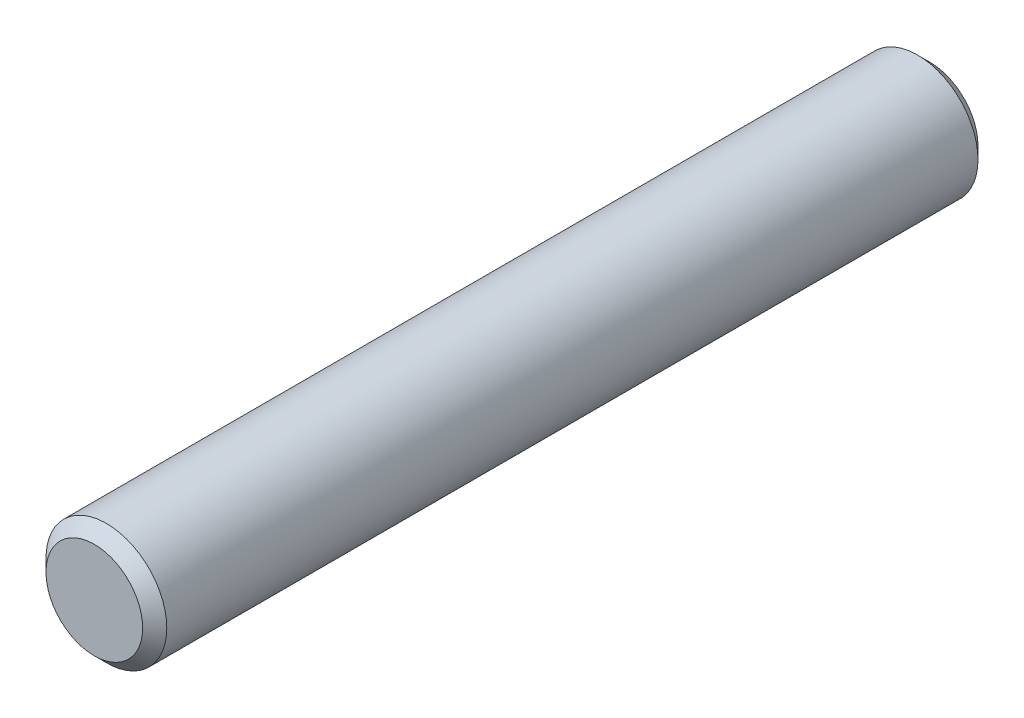
ISO-10303-21;
HEADER;
FILE_DESCRIPTION(('STEP AP214'),'2;1');
FILE_NAME('part.step','',(''),(''),'','','');
FILE_SCHEMA(('AUTOMOTIVE_DESIGN { 1 0 10303 214 1 1 1 1 }'));
ENDSEC;
DATA;
#1=APPLICATION_CONTEXT('core data for automotive mechanical design processes');
#2=APPLICATION_PROTOCOL_DEFINITION('international standard','automotive_design',2000,#1);
#3=PRODUCT_CONTEXT('',#1,'mechanical');
#4=PRODUCT('Part','Part','',(#3));
#5=PRODUCT_RELATED_PRODUCT_CATEGORY('part','',(#4));
#6=PRODUCT_DEFINITION_FORMATION('','',#4);
#7=PRODUCT_DEFINITION_CONTEXT('part definition',#1,'design');
#8=PRODUCT_DEFINITION('design','',#6,#7);
#9=PRODUCT_DEFINITION_SHAPE('','',#8);
#10=(LENGTH_UNIT() NAMED_UNIT(*) SI_UNIT(.MILLI.,.METRE.));
#11=(NAMED_UNIT(*) PLANE_ANGLE_UNIT() SI_UNIT($,.RADIAN.));
#12=(NAMED_UNIT(*) SI_UNIT($,.STERADIAN.) SOLID_ANGLE_UNIT());
#13=UNCERTAINTY_MEASURE_WITH_UNIT(LENGTH_MEASURE(1.E-05),#10,'distance_accuracy_value','');
#14=(GEOMETRIC_REPRESENTATION_CONTEXT(3) GLOBAL_UNCERTAINTY_ASSIGNED_CONTEXT((#13)) GLOBAL_UNIT_ASSIGNED_CONTEXT((#10,
#11,#12)) REPRESENTATION_CONTEXT('',''));
#15=CARTESIAN_POINT('',(0.,0.,0.));
#16=DIRECTION('',(0.,0.,1.));
#17=DIRECTION('',(1.,0.,0.));
#18=AXIS2_PLACEMENT_3D('',#15,#16,#17);
#19=CARTESIAN_POINT('',(0.,0.,20.75));
#20=DIRECTION('',(0.,0.,-1.));
#21=DIRECTION('',(-1.,0.,0.));
#22=AXIS2_PLACEMENT_3D('',#19,#20,#21);
#23=CYLINDRICAL_SURFACE('',#22,3.);
#24=CARTESIAN_POINT('',(0.,0.,-20.15));
#25=DIRECTION('',(0.,0.,1.));
#26=DIRECTION('',(1.,0.,0.));
#27=AXIS2_PLACEMENT_3D('',#24,#25,#26);
#28=CIRCLE('',#27,3.);
#29=CARTESIAN_POINT('',(3.,0.,-20.15));
#30=VERTEX_POINT('',#29);
#31=EDGE_CURVE('E47',#30,#30,#28,.T.);
#32=ORIENTED_EDGE('',*,*,#31,.T.);
#33=EDGE_LOOP('',(#32));
#34=FACE_BOUND('',#33,.T.);
#35=CARTESIAN_POINT('',(0.,0.,20.15));
#36=DIRECTION('',(0.,0.,1.));
#37=DIRECTION('',(1.,0.,0.));
#38=AXIS2_PLACEMENT_3D('',#35,#36,#37);
#39=CIRCLE('',#38,3.);
#40=CARTESIAN_POINT('',(3.,0.,20.15));
#41=VERTEX_POINT('',#40);
#42=EDGE_CURVE('E51',#41,#41,#39,.F.);
#43=ORIENTED_EDGE('',*,*,#42,.T.);
#44=EDGE_LOOP('',(#43));
#45=FACE_BOUND('',#44,.T.);
#46=ADVANCED_FACE('F34',(#34,#45),#23,.T.);
#47=CARTESIAN_POINT('',(0.,0.,20.75));
#48=DIRECTION('',(0.,0.,1.));
#49=DIRECTION('',(1.,0.,0.));
#50=AXIS2_PLACEMENT_3D('',#47,#48,#49);
#51=PLANE('',#50);
#52=CARTESIAN_POINT('',(0.,0.,20.75));
#53=DIRECTION('',(0.,0.,1.));
#54=DIRECTION('',(1.,0.,0.));
#55=AXIS2_PLACEMENT_3D('',#52,#53,#54);
#56=CIRCLE('',#55,2.40000000000001);
#57=CARTESIAN_POINT('',(2.40000000000001,0.,20.75));
#58=VERTEX_POINT('',#57);
#59=EDGE_CURVE('E10',#58,#58,#56,.T.);
#60=ORIENTED_EDGE('',*,*,#59,.T.);
#61=EDGE_LOOP('',(#60));
#62=FACE_BOUND('',#61,.T.);
#63=ADVANCED_FACE('F67',(#62),#51,.T.);
#64=CARTESIAN_POINT('',(0.,0.,-20.75));
#65=DIRECTION('',(0.,0.,1.));
#66=DIRECTION('',(1.,0.,0.));
#67=AXIS2_PLACEMENT_3D('',#64,#65,#66);
#68=PLANE('',#67);
#69=CARTESIAN_POINT('',(0.,0.,-20.75));
#70=DIRECTION('',(0.,0.,1.));
#71=DIRECTION('',(1.,0.,0.));
#72=AXIS2_PLACEMENT_3D('',#69,#70,#71);
#73=CIRCLE('',#72,2.39999999999998);
#74=CARTESIAN_POINT('',(2.39999999999998,0.,-20.75));
#75=VERTEX_POINT('',#74);
#76=EDGE_CURVE('E42',#75,#75,#73,.F.);
#77=ORIENTED_EDGE('',*,*,#76,.T.);
#78=EDGE_LOOP('',(#77));
#79=FACE_BOUND('',#78,.T.);
#80=ADVANCED_FACE('F64',(#79),#68,.F.);
#81=CARTESIAN_POINT('',(0.,0.,-20.15));
#82=DIRECTION('',(0.,0.,1.));
#83=DIRECTION('',(1.,0.,0.));
#84=AXIS2_PLACEMENT_3D('',#81,#82,#83);
#85=CONICAL_SURFACE('',#84,3.,0.785398163397454);
#86=ORIENTED_EDGE('',*,*,#76,.F.);
#87=EDGE_LOOP('',(#86));
#88=FACE_BOUND('',#87,.T.);
#89=ORIENTED_EDGE('',*,*,#31,.F.);
#90=EDGE_LOOP('',(#89));
#91=FACE_BOUND('',#90,.T.);
#92=ADVANCED_FACE('F60',(#88,#91),#85,.T.);
#93=CARTESIAN_POINT('',(0.,0.,20.75));
#94=DIRECTION('',(0.,0.,-1.));
#95=DIRECTION('',(-1.,0.,0.));
#96=AXIS2_PLACEMENT_3D('',#93,#94,#95);
#97=CONICAL_SURFACE('',#96,2.40000000000001,0.785398163397448);
#98=ORIENTED_EDGE('',*,*,#42,.F.);
#99=EDGE_LOOP('',(#98));
#100=FACE_BOUND('',#99,.T.);
#101=ORIENTED_EDGE('',*,*,#59,.F.);
#102=EDGE_LOOP('',(#101));
#103=FACE_BOUND('',#102,.T.);
#104=ADVANCED_FACE('F36',(#100,#103),#97,.T.);
#105=CLOSED_SHELL('',(#46,#63,#80,#92,#104));
#106=MANIFOLD_SOLID_BREP('B2',#105);
#107=ADVANCED_BREP_SHAPE_REPRESENTATION('',(#18,#106),#14);
#108=SHAPE_DEFINITION_REPRESENTATION(#9,#107);
ENDSEC;
END-ISO-10303-21;
